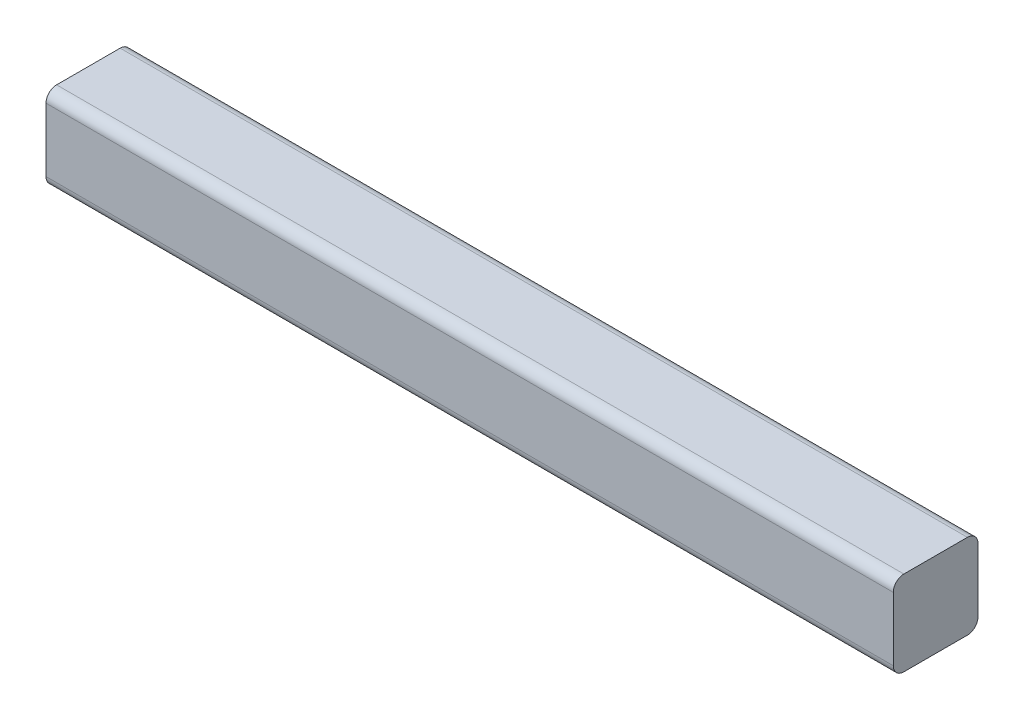
ISO-10303-21;
HEADER;
FILE_DESCRIPTION(('STEP AP214'),'2;1');
FILE_NAME('part.step','',(''),(''),'','','');
FILE_SCHEMA(('AUTOMOTIVE_DESIGN { 1 0 10303 214 1 1 1 1 }'));
ENDSEC;
DATA;
#1=APPLICATION_CONTEXT('core data for automotive mechanical design processes');
#2=APPLICATION_PROTOCOL_DEFINITION('international standard','automotive_design',2000,#1);
#3=PRODUCT_CONTEXT('',#1,'mechanical');
#4=PRODUCT('Part','Part','',(#3));
#5=PRODUCT_RELATED_PRODUCT_CATEGORY('part','',(#4));
#6=PRODUCT_DEFINITION_FORMATION('','',#4);
#7=PRODUCT_DEFINITION_CONTEXT('part definition',#1,'design');
#8=PRODUCT_DEFINITION('design','',#6,#7);
#9=PRODUCT_DEFINITION_SHAPE('','',#8);
#10=(LENGTH_UNIT() NAMED_UNIT(*) SI_UNIT(.MILLI.,.METRE.));
#11=(NAMED_UNIT(*) PLANE_ANGLE_UNIT() SI_UNIT($,.RADIAN.));
#12=(NAMED_UNIT(*) SI_UNIT($,.STERADIAN.) SOLID_ANGLE_UNIT());
#13=UNCERTAINTY_MEASURE_WITH_UNIT(LENGTH_MEASURE(1.E-05),#10,'distance_accuracy_value','');
#14=(GEOMETRIC_REPRESENTATION_CONTEXT(3) GLOBAL_UNCERTAINTY_ASSIGNED_CONTEXT((#13)) GLOBAL_UNIT_ASSIGNED_CONTEXT((#10,
#11,#12)) REPRESENTATION_CONTEXT('',''));
#15=CARTESIAN_POINT('',(0.,0.,0.));
#16=DIRECTION('',(0.,0.,1.));
#17=DIRECTION('',(1.,0.,0.));
#18=AXIS2_PLACEMENT_3D('',#15,#16,#17);
#19=CARTESIAN_POINT('',(127.,0.,0.));
#20=DIRECTION('',(0.,0.,1.));
#21=DIRECTION('',(0.,-1.,0.));
#22=AXIS2_PLACEMENT_3D('',#19,#20,#21);
#23=PLANE('',#22);
#24=DIRECTION('',(0.,1.,0.));
#25=VECTOR('',#24,1.);
#26=CARTESIAN_POINT('',(127.,0.,0.));
#27=LINE('',#26,#25);
#28=CARTESIAN_POINT('',(127.,-11.1125,0.));
#29=VERTEX_POINT('',#28);
#30=CARTESIAN_POINT('',(127.,-1.5875,0.));
#31=VERTEX_POINT('',#30);
#32=EDGE_CURVE('E118',#29,#31,#27,.T.);
#33=ORIENTED_EDGE('',*,*,#32,.F.);
#34=DIRECTION('',(-1.,0.,0.));
#35=VECTOR('',#34,1.);
#36=CARTESIAN_POINT('',(127.,-11.1125,0.));
#37=LINE('',#36,#35);
#38=CARTESIAN_POINT('',(0.,-11.1125,0.));
#39=VERTEX_POINT('',#38);
#40=EDGE_CURVE('E103',#29,#39,#37,.T.);
#41=ORIENTED_EDGE('',*,*,#40,.T.);
#42=DIRECTION('',(0.,1.,0.));
#43=VECTOR('',#42,1.);
#44=CARTESIAN_POINT('',(0.,0.,0.));
#45=LINE('',#44,#43);
#46=CARTESIAN_POINT('',(0.,-1.5875,0.));
#47=VERTEX_POINT('',#46);
#48=EDGE_CURVE('E115',#39,#47,#45,.T.);
#49=ORIENTED_EDGE('',*,*,#48,.T.);
#50=DIRECTION('',(-1.,0.,0.));
#51=VECTOR('',#50,1.);
#52=CARTESIAN_POINT('',(127.,-1.5875,0.));
#53=LINE('',#52,#51);
#54=EDGE_CURVE('E120',#47,#31,#53,.F.);
#55=ORIENTED_EDGE('',*,*,#54,.T.);
#56=EDGE_LOOP('',(#33,#41,#49,#55));
#57=FACE_BOUND('',#56,.T.);
#58=ADVANCED_FACE('F32',(#57),#23,.F.);
#59=CARTESIAN_POINT('',(127.,0.,0.));
#60=DIRECTION('',(0.,-1.,0.));
#61=DIRECTION('',(0.,0.,-1.));
#62=AXIS2_PLACEMENT_3D('',#59,#60,#61);
#63=PLANE('',#62);
#64=DIRECTION('',(0.,0.,1.));
#65=VECTOR('',#64,1.);
#66=CARTESIAN_POINT('',(127.,0.,0.));
#67=LINE('',#66,#65);
#68=CARTESIAN_POINT('',(127.,0.,1.5875));
#69=VERTEX_POINT('',#68);
#70=CARTESIAN_POINT('',(127.,0.,11.1125));
#71=VERTEX_POINT('',#70);
#72=EDGE_CURVE('E158',#69,#71,#67,.T.);
#73=ORIENTED_EDGE('',*,*,#72,.F.);
#74=DIRECTION('',(-1.,0.,0.));
#75=VECTOR('',#74,1.);
#76=CARTESIAN_POINT('',(127.,0.,1.5875));
#77=LINE('',#76,#75);
#78=CARTESIAN_POINT('',(0.,0.,1.5875));
#79=VERTEX_POINT('',#78);
#80=EDGE_CURVE('E11',#69,#79,#77,.T.);
#81=ORIENTED_EDGE('',*,*,#80,.T.);
#82=DIRECTION('',(0.,0.,1.));
#83=VECTOR('',#82,1.);
#84=CARTESIAN_POINT('',(0.,0.,0.));
#85=LINE('',#84,#83);
#86=CARTESIAN_POINT('',(0.,0.,11.1125));
#87=VERTEX_POINT('',#86);
#88=EDGE_CURVE('E125',#79,#87,#85,.T.);
#89=ORIENTED_EDGE('',*,*,#88,.T.);
#90=DIRECTION('',(-1.,0.,0.));
#91=VECTOR('',#90,1.);
#92=CARTESIAN_POINT('',(127.,0.,11.1125));
#93=LINE('',#92,#91);
#94=EDGE_CURVE('E40',#87,#71,#93,.F.);
#95=ORIENTED_EDGE('',*,*,#94,.T.);
#96=EDGE_LOOP('',(#73,#81,#89,#95));
#97=FACE_BOUND('',#96,.T.);
#98=ADVANCED_FACE('F157',(#97),#63,.F.);
#99=CARTESIAN_POINT('',(127.,0.,12.7));
#100=DIRECTION('',(0.,0.,-1.));
#101=DIRECTION('',(0.,1.,0.));
#102=AXIS2_PLACEMENT_3D('',#99,#100,#101);
#103=PLANE('',#102);
#104=DIRECTION('',(0.,-1.,0.));
#105=VECTOR('',#104,1.);
#106=CARTESIAN_POINT('',(0.,0.,12.7));
#107=LINE('',#106,#105);
#108=CARTESIAN_POINT('',(0.,-1.5875,12.7));
#109=VERTEX_POINT('',#108);
#110=CARTESIAN_POINT('',(0.,-11.1125,12.7));
#111=VERTEX_POINT('',#110);
#112=EDGE_CURVE('E128',#109,#111,#107,.T.);
#113=ORIENTED_EDGE('',*,*,#112,.T.);
#114=DIRECTION('',(-1.,0.,0.));
#115=VECTOR('',#114,1.);
#116=CARTESIAN_POINT('',(127.,-11.1125,12.7));
#117=LINE('',#116,#115);
#118=CARTESIAN_POINT('',(127.,-11.1125,12.7));
#119=VERTEX_POINT('',#118);
#120=EDGE_CURVE('E47',#111,#119,#117,.F.);
#121=ORIENTED_EDGE('',*,*,#120,.T.);
#122=DIRECTION('',(0.,-1.,0.));
#123=VECTOR('',#122,1.);
#124=CARTESIAN_POINT('',(127.,0.,12.7));
#125=LINE('',#124,#123);
#126=CARTESIAN_POINT('',(127.,-1.5875,12.7));
#127=VERTEX_POINT('',#126);
#128=EDGE_CURVE('E164',#127,#119,#125,.T.);
#129=ORIENTED_EDGE('',*,*,#128,.F.);
#130=DIRECTION('',(-1.,0.,0.));
#131=VECTOR('',#130,1.);
#132=CARTESIAN_POINT('',(127.,-1.5875,12.7));
#133=LINE('',#132,#131);
#134=EDGE_CURVE('E151',#127,#109,#133,.T.);
#135=ORIENTED_EDGE('',*,*,#134,.T.);
#136=EDGE_LOOP('',(#113,#121,#129,#135));
#137=FACE_BOUND('',#136,.T.);
#138=ADVANCED_FACE('F168',(#137),#103,.F.);
#139=CARTESIAN_POINT('',(127.,-12.7,0.));
#140=DIRECTION('',(0.,1.,0.));
#141=DIRECTION('',(0.,0.,1.));
#142=AXIS2_PLACEMENT_3D('',#139,#140,#141);
#143=PLANE('',#142);
#144=DIRECTION('',(0.,0.,-1.));
#145=VECTOR('',#144,1.);
#146=CARTESIAN_POINT('',(0.,-12.7,0.));
#147=LINE('',#146,#145);
#148=CARTESIAN_POINT('',(0.,-12.7,11.1125));
#149=VERTEX_POINT('',#148);
#150=CARTESIAN_POINT('',(0.,-12.7,1.5875));
#151=VERTEX_POINT('',#150);
#152=EDGE_CURVE('E135',#149,#151,#147,.T.);
#153=ORIENTED_EDGE('',*,*,#152,.T.);
#154=DIRECTION('',(-1.,0.,0.));
#155=VECTOR('',#154,1.);
#156=CARTESIAN_POINT('',(127.,-12.7,1.5875));
#157=LINE('',#156,#155);
#158=CARTESIAN_POINT('',(127.,-12.7,1.5875));
#159=VERTEX_POINT('',#158);
#160=EDGE_CURVE('E104',#151,#159,#157,.F.);
#161=ORIENTED_EDGE('',*,*,#160,.T.);
#162=DIRECTION('',(0.,0.,-1.));
#163=VECTOR('',#162,1.);
#164=CARTESIAN_POINT('',(127.,-12.7,0.));
#165=LINE('',#164,#163);
#166=CARTESIAN_POINT('',(127.,-12.7,11.1125));
#167=VERTEX_POINT('',#166);
#168=EDGE_CURVE('E131',#167,#159,#165,.T.);
#169=ORIENTED_EDGE('',*,*,#168,.F.);
#170=DIRECTION('',(-1.,0.,0.));
#171=VECTOR('',#170,1.);
#172=CARTESIAN_POINT('',(127.,-12.7,11.1125));
#173=LINE('',#172,#171);
#174=EDGE_CURVE('E109',#167,#149,#173,.T.);
#175=ORIENTED_EDGE('',*,*,#174,.T.);
#176=EDGE_LOOP('',(#153,#161,#169,#175));
#177=FACE_BOUND('',#176,.T.);
#178=ADVANCED_FACE('F175',(#177),#143,.F.);
#179=CARTESIAN_POINT('',(127.,0.,0.));
#180=DIRECTION('',(-1.,0.,0.));
#181=DIRECTION('',(0.,0.,1.));
#182=AXIS2_PLACEMENT_3D('',#179,#180,#181);
#183=PLANE('',#182);
#184=ORIENTED_EDGE('',*,*,#168,.T.);
#185=CARTESIAN_POINT('',(127.,-11.1125,1.5875));
#186=DIRECTION('',(-1.,0.,0.));
#187=DIRECTION('',(0.,0.,1.));
#188=AXIS2_PLACEMENT_3D('',#185,#186,#187);
#189=CIRCLE('',#188,1.5875);
#190=EDGE_CURVE('E149',#159,#29,#189,.F.);
#191=ORIENTED_EDGE('',*,*,#190,.T.);
#192=ORIENTED_EDGE('',*,*,#32,.T.);
#193=CARTESIAN_POINT('',(127.,-1.5875,1.5875));
#194=DIRECTION('',(-1.,0.,0.));
#195=DIRECTION('',(0.,0.,1.));
#196=AXIS2_PLACEMENT_3D('',#193,#194,#195);
#197=CIRCLE('',#196,1.5875);
#198=EDGE_CURVE('E145',#31,#69,#197,.F.);
#199=ORIENTED_EDGE('',*,*,#198,.T.);
#200=ORIENTED_EDGE('',*,*,#72,.T.);
#201=CARTESIAN_POINT('',(127.,-1.5875,11.1125));
#202=DIRECTION('',(-1.,0.,0.));
#203=DIRECTION('',(0.,0.,1.));
#204=AXIS2_PLACEMENT_3D('',#201,#202,#203);
#205=CIRCLE('',#204,1.5875);
#206=EDGE_CURVE('E54',#71,#127,#205,.F.);
#207=ORIENTED_EDGE('',*,*,#206,.T.);
#208=ORIENTED_EDGE('',*,*,#128,.T.);
#209=CARTESIAN_POINT('',(127.,-11.1125,11.1125));
#210=DIRECTION('',(-1.,0.,0.));
#211=DIRECTION('',(0.,0.,1.));
#212=AXIS2_PLACEMENT_3D('',#209,#210,#211);
#213=CIRCLE('',#212,1.5875);
#214=EDGE_CURVE('E147',#119,#167,#213,.F.);
#215=ORIENTED_EDGE('',*,*,#214,.T.);
#216=EDGE_LOOP('',(#184,#191,#192,#199,#200,#207,#208,#215));
#217=FACE_BOUND('',#216,.T.);
#218=ADVANCED_FACE('F162',(#217),#183,.F.);
#219=CARTESIAN_POINT('',(0.,0.,0.));
#220=DIRECTION('',(-1.,0.,0.));
#221=DIRECTION('',(0.,0.,1.));
#222=AXIS2_PLACEMENT_3D('',#219,#220,#221);
#223=PLANE('',#222);
#224=ORIENTED_EDGE('',*,*,#48,.F.);
#225=CARTESIAN_POINT('',(0.,-11.1125,1.5875));
#226=DIRECTION('',(-1.,0.,0.));
#227=DIRECTION('',(0.,0.,1.));
#228=AXIS2_PLACEMENT_3D('',#225,#226,#227);
#229=CIRCLE('',#228,1.5875);
#230=EDGE_CURVE('E99',#39,#151,#229,.T.);
#231=ORIENTED_EDGE('',*,*,#230,.T.);
#232=ORIENTED_EDGE('',*,*,#152,.F.);
#233=CARTESIAN_POINT('',(0.,-11.1125,11.1125));
#234=DIRECTION('',(-1.,0.,0.));
#235=DIRECTION('',(0.,0.,1.));
#236=AXIS2_PLACEMENT_3D('',#233,#234,#235);
#237=CIRCLE('',#236,1.5875);
#238=EDGE_CURVE('E110',#149,#111,#237,.T.);
#239=ORIENTED_EDGE('',*,*,#238,.T.);
#240=ORIENTED_EDGE('',*,*,#112,.F.);
#241=CARTESIAN_POINT('',(0.,-1.5875,11.1125));
#242=DIRECTION('',(-1.,0.,0.));
#243=DIRECTION('',(0.,0.,1.));
#244=AXIS2_PLACEMENT_3D('',#241,#242,#243);
#245=CIRCLE('',#244,1.5875);
#246=EDGE_CURVE('E119',#109,#87,#245,.T.);
#247=ORIENTED_EDGE('',*,*,#246,.T.);
#248=ORIENTED_EDGE('',*,*,#88,.F.);
#249=CARTESIAN_POINT('',(0.,-1.5875,1.5875));
#250=DIRECTION('',(-1.,0.,0.));
#251=DIRECTION('',(0.,0.,1.));
#252=AXIS2_PLACEMENT_3D('',#249,#250,#251);
#253=CIRCLE('',#252,1.5875);
#254=EDGE_CURVE('E124',#79,#47,#253,.T.);
#255=ORIENTED_EDGE('',*,*,#254,.T.);
#256=EDGE_LOOP('',(#224,#231,#232,#239,#240,#247,#248,#255));
#257=FACE_BOUND('',#256,.T.);
#258=ADVANCED_FACE('F122',(#257),#223,.T.);
#259=CARTESIAN_POINT('',(127.,-11.1125,1.5875));
#260=DIRECTION('',(-1.,0.,0.));
#261=DIRECTION('',(0.,0.,1.));
#262=AXIS2_PLACEMENT_3D('',#259,#260,#261);
#263=CYLINDRICAL_SURFACE('',#262,1.5875);
#264=ORIENTED_EDGE('',*,*,#190,.F.);
#265=ORIENTED_EDGE('',*,*,#160,.F.);
#266=ORIENTED_EDGE('',*,*,#230,.F.);
#267=ORIENTED_EDGE('',*,*,#40,.F.);
#268=EDGE_LOOP('',(#264,#265,#266,#267));
#269=FACE_BOUND('',#268,.T.);
#270=ADVANCED_FACE('F102',(#269),#263,.T.);
#271=CARTESIAN_POINT('',(127.,-11.1125,11.1125));
#272=DIRECTION('',(-1.,0.,0.));
#273=DIRECTION('',(0.,0.,1.));
#274=AXIS2_PLACEMENT_3D('',#271,#272,#273);
#275=CYLINDRICAL_SURFACE('',#274,1.5875);
#276=ORIENTED_EDGE('',*,*,#214,.F.);
#277=ORIENTED_EDGE('',*,*,#120,.F.);
#278=ORIENTED_EDGE('',*,*,#238,.F.);
#279=ORIENTED_EDGE('',*,*,#174,.F.);
#280=EDGE_LOOP('',(#276,#277,#278,#279));
#281=FACE_BOUND('',#280,.T.);
#282=ADVANCED_FACE('F172',(#281),#275,.T.);
#283=CARTESIAN_POINT('',(127.,-1.5875,1.5875));
#284=DIRECTION('',(-1.,0.,0.));
#285=DIRECTION('',(0.,0.,1.));
#286=AXIS2_PLACEMENT_3D('',#283,#284,#285);
#287=CYLINDRICAL_SURFACE('',#286,1.5875);
#288=ORIENTED_EDGE('',*,*,#198,.F.);
#289=ORIENTED_EDGE('',*,*,#54,.F.);
#290=ORIENTED_EDGE('',*,*,#254,.F.);
#291=ORIENTED_EDGE('',*,*,#80,.F.);
#292=EDGE_LOOP('',(#288,#289,#290,#291));
#293=FACE_BOUND('',#292,.T.);
#294=ADVANCED_FACE('F178',(#293),#287,.T.);
#295=CARTESIAN_POINT('',(127.,-1.5875,11.1125));
#296=DIRECTION('',(-1.,0.,0.));
#297=DIRECTION('',(0.,0.,1.));
#298=AXIS2_PLACEMENT_3D('',#295,#296,#297);
#299=CYLINDRICAL_SURFACE('',#298,1.5875);
#300=ORIENTED_EDGE('',*,*,#206,.F.);
#301=ORIENTED_EDGE('',*,*,#94,.F.);
#302=ORIENTED_EDGE('',*,*,#246,.F.);
#303=ORIENTED_EDGE('',*,*,#134,.F.);
#304=EDGE_LOOP('',(#300,#301,#302,#303));
#305=FACE_BOUND('',#304,.T.);
#306=ADVANCED_FACE('F34',(#305),#299,.T.);
#307=CLOSED_SHELL('',(#58,#98,#138,#178,#218,#258,#270,#282,#294,#306));
#308=MANIFOLD_SOLID_BREP('B2',#307);
#309=ADVANCED_BREP_SHAPE_REPRESENTATION('',(#18,#308),#14);
#310=SHAPE_DEFINITION_REPRESENTATION(#9,#309);
ENDSEC;
END-ISO-10303-21;
